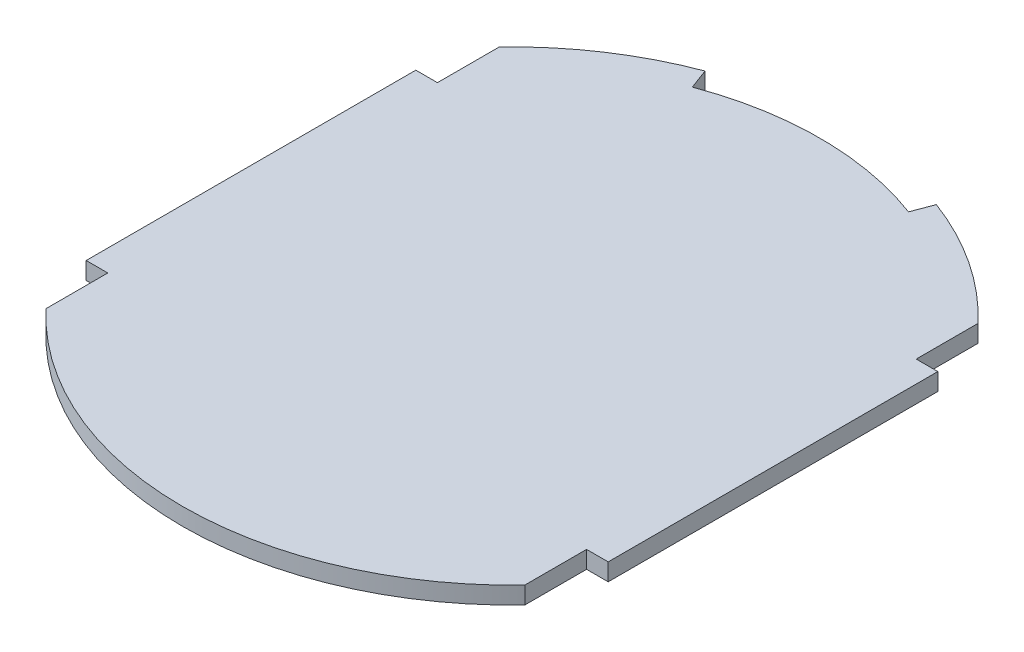
ISO-10303-21;
HEADER;
FILE_DESCRIPTION(('STEP AP214'),'2;1');
FILE_NAME('part.step','',(''),(''),'','','');
FILE_SCHEMA(('AUTOMOTIVE_DESIGN { 1 0 10303 214 1 1 1 1 }'));
ENDSEC;
DATA;
#1=APPLICATION_CONTEXT('core data for automotive mechanical design processes');
#2=APPLICATION_PROTOCOL_DEFINITION('international standard','automotive_design',2000,#1);
#3=PRODUCT_CONTEXT('',#1,'mechanical');
#4=PRODUCT('Part','Part','',(#3));
#5=PRODUCT_RELATED_PRODUCT_CATEGORY('part','',(#4));
#6=PRODUCT_DEFINITION_FORMATION('','',#4);
#7=PRODUCT_DEFINITION_CONTEXT('part definition',#1,'design');
#8=PRODUCT_DEFINITION('design','',#6,#7);
#9=PRODUCT_DEFINITION_SHAPE('','',#8);
#10=(LENGTH_UNIT() NAMED_UNIT(*) SI_UNIT(.MILLI.,.METRE.));
#11=(NAMED_UNIT(*) PLANE_ANGLE_UNIT() SI_UNIT($,.RADIAN.));
#12=(NAMED_UNIT(*) SI_UNIT($,.STERADIAN.) SOLID_ANGLE_UNIT());
#13=UNCERTAINTY_MEASURE_WITH_UNIT(LENGTH_MEASURE(1.E-05),#10,'distance_accuracy_value','');
#14=(GEOMETRIC_REPRESENTATION_CONTEXT(3) GLOBAL_UNCERTAINTY_ASSIGNED_CONTEXT((#13)) GLOBAL_UNIT_ASSIGNED_CONTEXT((#10,
#11,#12)) REPRESENTATION_CONTEXT('',''));
#15=CARTESIAN_POINT('',(0.,0.,0.));
#16=DIRECTION('',(0.,0.,1.));
#17=DIRECTION('',(1.,0.,0.));
#18=AXIS2_PLACEMENT_3D('',#15,#16,#17);
#19=CARTESIAN_POINT('',(0.,1.6,0.));
#20=DIRECTION('',(0.,-1.,0.));
#21=DIRECTION('',(0.,0.,-1.));
#22=AXIS2_PLACEMENT_3D('',#19,#20,#21);
#23=CYLINDRICAL_SURFACE('',#22,30.5);
#24=DIRECTION('',(0.,1.,0.));
#25=VECTOR('',#24,1.);
#26=CARTESIAN_POINT('',(-10.7017543859649,-8.4,-28.5608552578959));
#27=LINE('',#26,#25);
#28=CARTESIAN_POINT('',(-10.7017543859649,0.,-28.5608552578959));
#29=VERTEX_POINT('',#28);
#30=CARTESIAN_POINT('',(-10.7017543859649,1.6,-28.5608552578959));
#31=VERTEX_POINT('',#30);
#32=EDGE_CURVE('E178',#29,#31,#27,.T.);
#33=ORIENTED_EDGE('',*,*,#32,.F.);
#34=CARTESIAN_POINT('',(0.,0.,0.));
#35=DIRECTION('',(0.,1.,0.));
#36=DIRECTION('',(0.,0.,1.));
#37=AXIS2_PLACEMENT_3D('',#34,#35,#36);
#38=CIRCLE('',#37,30.5);
#39=CARTESIAN_POINT('',(-22.15,0.,-20.9672959629991));
#40=VERTEX_POINT('',#39);
#41=EDGE_CURVE('E195',#29,#40,#38,.T.);
#42=ORIENTED_EDGE('',*,*,#41,.T.);
#43=DIRECTION('',(0.,-1.,0.));
#44=VECTOR('',#43,1.);
#45=CARTESIAN_POINT('',(-22.15,1.6,-20.9672959629991));
#46=LINE('',#45,#44);
#47=CARTESIAN_POINT('',(-22.15,1.6,-20.9672959629991));
#48=VERTEX_POINT('',#47);
#49=EDGE_CURVE('E163',#48,#40,#46,.T.);
#50=ORIENTED_EDGE('',*,*,#49,.F.);
#51=CARTESIAN_POINT('',(0.,1.6,0.));
#52=DIRECTION('',(0.,1.,0.));
#53=DIRECTION('',(0.,0.,1.));
#54=AXIS2_PLACEMENT_3D('',#51,#52,#53);
#55=CIRCLE('',#54,30.5);
#56=EDGE_CURVE('E152',#31,#48,#55,.T.);
#57=ORIENTED_EDGE('',*,*,#56,.F.);
#58=EDGE_LOOP('',(#33,#42,#50,#57));
#59=FACE_BOUND('',#58,.T.);
#60=ADVANCED_FACE('F33',(#59),#23,.T.);
#61=CARTESIAN_POINT('',(-24.15,1.6,-15.25));
#62=DIRECTION('',(0.,0.,1.));
#63=DIRECTION('',(1.,0.,0.));
#64=AXIS2_PLACEMENT_3D('',#61,#62,#63);
#65=PLANE('',#64);
#66=DIRECTION('',(-1.,0.,0.));
#67=VECTOR('',#66,1.);
#68=CARTESIAN_POINT('',(-24.15,0.,-15.25));
#69=LINE('',#68,#67);
#70=CARTESIAN_POINT('',(-22.15,0.,-15.25));
#71=VERTEX_POINT('',#70);
#72=CARTESIAN_POINT('',(-24.15,0.,-15.25));
#73=VERTEX_POINT('',#72);
#74=EDGE_CURVE('E174',#71,#73,#69,.T.);
#75=ORIENTED_EDGE('',*,*,#74,.T.);
#76=DIRECTION('',(0.,-1.,0.));
#77=VECTOR('',#76,1.);
#78=CARTESIAN_POINT('',(-24.15,1.6,-15.25));
#79=LINE('',#78,#77);
#80=CARTESIAN_POINT('',(-24.15,1.6,-15.25));
#81=VERTEX_POINT('',#80);
#82=EDGE_CURVE('E224',#81,#73,#79,.T.);
#83=ORIENTED_EDGE('',*,*,#82,.F.);
#84=DIRECTION('',(-1.,0.,0.));
#85=VECTOR('',#84,1.);
#86=CARTESIAN_POINT('',(-24.15,1.6,-15.25));
#87=LINE('',#86,#85);
#88=CARTESIAN_POINT('',(-22.15,1.6,-15.25));
#89=VERTEX_POINT('',#88);
#90=EDGE_CURVE('E199',#89,#81,#87,.T.);
#91=ORIENTED_EDGE('',*,*,#90,.F.);
#92=DIRECTION('',(0.,-1.,0.));
#93=VECTOR('',#92,1.);
#94=CARTESIAN_POINT('',(-22.15,1.6,-15.25));
#95=LINE('',#94,#93);
#96=EDGE_CURVE('E170',#89,#71,#95,.T.);
#97=ORIENTED_EDGE('',*,*,#96,.T.);
#98=EDGE_LOOP('',(#75,#83,#91,#97));
#99=FACE_BOUND('',#98,.T.);
#100=ADVANCED_FACE('F35',(#99),#65,.F.);
#101=CARTESIAN_POINT('',(-24.15,1.6,-15.25));
#102=DIRECTION('',(1.,0.,0.));
#103=DIRECTION('',(0.,0.,-1.));
#104=AXIS2_PLACEMENT_3D('',#101,#102,#103);
#105=PLANE('',#104);
#106=DIRECTION('',(0.,0.,1.));
#107=VECTOR('',#106,1.);
#108=CARTESIAN_POINT('',(-24.15,0.,-15.25));
#109=LINE('',#108,#107);
#110=CARTESIAN_POINT('',(-24.15,0.,15.25));
#111=VERTEX_POINT('',#110);
#112=EDGE_CURVE('E177',#73,#111,#109,.T.);
#113=ORIENTED_EDGE('',*,*,#112,.T.);
#114=DIRECTION('',(0.,-1.,0.));
#115=VECTOR('',#114,1.);
#116=CARTESIAN_POINT('',(-24.15,1.6,15.25));
#117=LINE('',#116,#115);
#118=CARTESIAN_POINT('',(-24.15,1.6,15.25));
#119=VERTEX_POINT('',#118);
#120=EDGE_CURVE('E221',#119,#111,#117,.T.);
#121=ORIENTED_EDGE('',*,*,#120,.F.);
#122=DIRECTION('',(0.,0.,1.));
#123=VECTOR('',#122,1.);
#124=CARTESIAN_POINT('',(-24.15,1.6,-15.25));
#125=LINE('',#124,#123);
#126=EDGE_CURVE('E111',#81,#119,#125,.T.);
#127=ORIENTED_EDGE('',*,*,#126,.F.);
#128=ORIENTED_EDGE('',*,*,#82,.T.);
#129=EDGE_LOOP('',(#113,#121,#127,#128));
#130=FACE_BOUND('',#129,.T.);
#131=ADVANCED_FACE('F294',(#130),#105,.F.);
#132=CARTESIAN_POINT('',(-24.15,1.6,15.25));
#133=DIRECTION('',(0.,0.,-1.));
#134=DIRECTION('',(-1.,0.,0.));
#135=AXIS2_PLACEMENT_3D('',#132,#133,#134);
#136=PLANE('',#135);
#137=DIRECTION('',(1.,0.,0.));
#138=VECTOR('',#137,1.);
#139=CARTESIAN_POINT('',(-24.15,0.,15.25));
#140=LINE('',#139,#138);
#141=CARTESIAN_POINT('',(-22.15,0.,15.25));
#142=VERTEX_POINT('',#141);
#143=EDGE_CURVE('E180',#111,#142,#140,.T.);
#144=ORIENTED_EDGE('',*,*,#143,.T.);
#145=DIRECTION('',(0.,-1.,0.));
#146=VECTOR('',#145,1.);
#147=CARTESIAN_POINT('',(-22.15,1.6,15.25));
#148=LINE('',#147,#146);
#149=CARTESIAN_POINT('',(-22.15,1.6,15.25));
#150=VERTEX_POINT('',#149);
#151=EDGE_CURVE('E218',#150,#142,#148,.T.);
#152=ORIENTED_EDGE('',*,*,#151,.F.);
#153=DIRECTION('',(1.,0.,0.));
#154=VECTOR('',#153,1.);
#155=CARTESIAN_POINT('',(-24.15,1.6,15.25));
#156=LINE('',#155,#154);
#157=EDGE_CURVE('E250',#119,#150,#156,.T.);
#158=ORIENTED_EDGE('',*,*,#157,.F.);
#159=ORIENTED_EDGE('',*,*,#120,.T.);
#160=EDGE_LOOP('',(#144,#152,#158,#159));
#161=FACE_BOUND('',#160,.T.);
#162=ADVANCED_FACE('F293',(#161),#136,.F.);
#163=CARTESIAN_POINT('',(-22.15,1.6,20.9672959629991));
#164=DIRECTION('',(1.,0.,0.));
#165=DIRECTION('',(0.,0.,-1.));
#166=AXIS2_PLACEMENT_3D('',#163,#164,#165);
#167=PLANE('',#166);
#168=DIRECTION('',(0.,0.,1.));
#169=VECTOR('',#168,1.);
#170=CARTESIAN_POINT('',(-22.15,0.,20.9672959629991));
#171=LINE('',#170,#169);
#172=CARTESIAN_POINT('',(-22.15,0.,20.9672959629991));
#173=VERTEX_POINT('',#172);
#174=EDGE_CURVE('E182',#142,#173,#171,.T.);
#175=ORIENTED_EDGE('',*,*,#174,.T.);
#176=DIRECTION('',(0.,-1.,0.));
#177=VECTOR('',#176,1.);
#178=CARTESIAN_POINT('',(-22.15,1.6,20.9672959629991));
#179=LINE('',#178,#177);
#180=CARTESIAN_POINT('',(-22.15,1.6,20.9672959629991));
#181=VERTEX_POINT('',#180);
#182=EDGE_CURVE('E215',#181,#173,#179,.T.);
#183=ORIENTED_EDGE('',*,*,#182,.F.);
#184=DIRECTION('',(0.,0.,1.));
#185=VECTOR('',#184,1.);
#186=CARTESIAN_POINT('',(-22.15,1.6,20.9672959629991));
#187=LINE('',#186,#185);
#188=EDGE_CURVE('E252',#150,#181,#187,.T.);
#189=ORIENTED_EDGE('',*,*,#188,.F.);
#190=ORIENTED_EDGE('',*,*,#151,.T.);
#191=EDGE_LOOP('',(#175,#183,#189,#190));
#192=FACE_BOUND('',#191,.T.);
#193=ADVANCED_FACE('F288',(#192),#167,.F.);
#194=CARTESIAN_POINT('',(0.,1.6,0.));
#195=DIRECTION('',(0.,-1.,0.));
#196=DIRECTION('',(0.,0.,-1.));
#197=AXIS2_PLACEMENT_3D('',#194,#195,#196);
#198=CYLINDRICAL_SURFACE('',#197,30.5);
#199=CARTESIAN_POINT('',(0.,0.,0.));
#200=DIRECTION('',(0.,1.,0.));
#201=DIRECTION('',(0.,0.,1.));
#202=AXIS2_PLACEMENT_3D('',#199,#200,#201);
#203=CIRCLE('',#202,30.5);
#204=CARTESIAN_POINT('',(22.15,0.,20.9672959629991));
#205=VERTEX_POINT('',#204);
#206=EDGE_CURVE('E184',#173,#205,#203,.T.);
#207=ORIENTED_EDGE('',*,*,#206,.T.);
#208=DIRECTION('',(0.,-1.,0.));
#209=VECTOR('',#208,1.);
#210=CARTESIAN_POINT('',(22.15,1.6,20.9672959629991));
#211=LINE('',#210,#209);
#212=CARTESIAN_POINT('',(22.15,1.6,20.9672959629991));
#213=VERTEX_POINT('',#212);
#214=EDGE_CURVE('E212',#213,#205,#211,.T.);
#215=ORIENTED_EDGE('',*,*,#214,.F.);
#216=CARTESIAN_POINT('',(0.,1.6,0.));
#217=DIRECTION('',(0.,1.,0.));
#218=DIRECTION('',(0.,0.,1.));
#219=AXIS2_PLACEMENT_3D('',#216,#217,#218);
#220=CIRCLE('',#219,30.5);
#221=EDGE_CURVE('E254',#181,#213,#220,.T.);
#222=ORIENTED_EDGE('',*,*,#221,.F.);
#223=ORIENTED_EDGE('',*,*,#182,.T.);
#224=EDGE_LOOP('',(#207,#215,#222,#223));
#225=FACE_BOUND('',#224,.T.);
#226=ADVANCED_FACE('F283',(#225),#198,.T.);
#227=CARTESIAN_POINT('',(22.15,1.6,15.25));
#228=DIRECTION('',(-1.,0.,0.));
#229=DIRECTION('',(0.,0.,1.));
#230=AXIS2_PLACEMENT_3D('',#227,#228,#229);
#231=PLANE('',#230);
#232=DIRECTION('',(0.,0.,-1.));
#233=VECTOR('',#232,1.);
#234=CARTESIAN_POINT('',(22.15,0.,15.25));
#235=LINE('',#234,#233);
#236=CARTESIAN_POINT('',(22.15,0.,15.25));
#237=VERTEX_POINT('',#236);
#238=EDGE_CURVE('E186',#205,#237,#235,.T.);
#239=ORIENTED_EDGE('',*,*,#238,.T.);
#240=DIRECTION('',(0.,-1.,0.));
#241=VECTOR('',#240,1.);
#242=CARTESIAN_POINT('',(22.15,1.6,15.25));
#243=LINE('',#242,#241);
#244=CARTESIAN_POINT('',(22.15,1.6,15.25));
#245=VERTEX_POINT('',#244);
#246=EDGE_CURVE('E209',#245,#237,#243,.T.);
#247=ORIENTED_EDGE('',*,*,#246,.F.);
#248=DIRECTION('',(0.,0.,-1.));
#249=VECTOR('',#248,1.);
#250=CARTESIAN_POINT('',(22.15,1.6,15.25));
#251=LINE('',#250,#249);
#252=EDGE_CURVE('E256',#213,#245,#251,.T.);
#253=ORIENTED_EDGE('',*,*,#252,.F.);
#254=ORIENTED_EDGE('',*,*,#214,.T.);
#255=EDGE_LOOP('',(#239,#247,#253,#254));
#256=FACE_BOUND('',#255,.T.);
#257=ADVANCED_FACE('F279',(#256),#231,.F.);
#258=CARTESIAN_POINT('',(22.15,1.6,15.25));
#259=DIRECTION('',(0.,0.,-1.));
#260=DIRECTION('',(-1.,0.,0.));
#261=AXIS2_PLACEMENT_3D('',#258,#259,#260);
#262=PLANE('',#261);
#263=DIRECTION('',(1.,0.,0.));
#264=VECTOR('',#263,1.);
#265=CARTESIAN_POINT('',(22.15,0.,15.25));
#266=LINE('',#265,#264);
#267=CARTESIAN_POINT('',(24.15,0.,15.25));
#268=VERTEX_POINT('',#267);
#269=EDGE_CURVE('E188',#237,#268,#266,.T.);
#270=ORIENTED_EDGE('',*,*,#269,.T.);
#271=DIRECTION('',(0.,-1.,0.));
#272=VECTOR('',#271,1.);
#273=CARTESIAN_POINT('',(24.15,1.6,15.25));
#274=LINE('',#273,#272);
#275=CARTESIAN_POINT('',(24.15,1.6,15.25));
#276=VERTEX_POINT('',#275);
#277=EDGE_CURVE('E206',#276,#268,#274,.T.);
#278=ORIENTED_EDGE('',*,*,#277,.F.);
#279=DIRECTION('',(1.,0.,0.));
#280=VECTOR('',#279,1.);
#281=CARTESIAN_POINT('',(22.15,1.6,15.25));
#282=LINE('',#281,#280);
#283=EDGE_CURVE('E258',#245,#276,#282,.T.);
#284=ORIENTED_EDGE('',*,*,#283,.F.);
#285=ORIENTED_EDGE('',*,*,#246,.T.);
#286=EDGE_LOOP('',(#270,#278,#284,#285));
#287=FACE_BOUND('',#286,.T.);
#288=ADVANCED_FACE('F275',(#287),#262,.F.);
#289=CARTESIAN_POINT('',(24.15,1.6,15.25));
#290=DIRECTION('',(-1.,0.,0.));
#291=DIRECTION('',(0.,0.,1.));
#292=AXIS2_PLACEMENT_3D('',#289,#290,#291);
#293=PLANE('',#292);
#294=DIRECTION('',(0.,0.,-1.));
#295=VECTOR('',#294,1.);
#296=CARTESIAN_POINT('',(24.15,0.,15.25));
#297=LINE('',#296,#295);
#298=CARTESIAN_POINT('',(24.15,0.,-15.25));
#299=VERTEX_POINT('',#298);
#300=EDGE_CURVE('E190',#268,#299,#297,.T.);
#301=ORIENTED_EDGE('',*,*,#300,.T.);
#302=DIRECTION('',(0.,-1.,0.));
#303=VECTOR('',#302,1.);
#304=CARTESIAN_POINT('',(24.15,1.6,-15.25));
#305=LINE('',#304,#303);
#306=CARTESIAN_POINT('',(24.15,1.6,-15.25));
#307=VERTEX_POINT('',#306);
#308=EDGE_CURVE('E203',#307,#299,#305,.T.);
#309=ORIENTED_EDGE('',*,*,#308,.F.);
#310=DIRECTION('',(0.,0.,-1.));
#311=VECTOR('',#310,1.);
#312=CARTESIAN_POINT('',(24.15,1.6,15.25));
#313=LINE('',#312,#311);
#314=EDGE_CURVE('E260',#276,#307,#313,.T.);
#315=ORIENTED_EDGE('',*,*,#314,.F.);
#316=ORIENTED_EDGE('',*,*,#277,.T.);
#317=EDGE_LOOP('',(#301,#309,#315,#316));
#318=FACE_BOUND('',#317,.T.);
#319=ADVANCED_FACE('F266',(#318),#293,.F.);
#320=CARTESIAN_POINT('',(22.15,1.6,-15.25));
#321=DIRECTION('',(0.,0.,1.));
#322=DIRECTION('',(1.,0.,0.));
#323=AXIS2_PLACEMENT_3D('',#320,#321,#322);
#324=PLANE('',#323);
#325=DIRECTION('',(-1.,0.,0.));
#326=VECTOR('',#325,1.);
#327=CARTESIAN_POINT('',(22.15,0.,-15.25));
#328=LINE('',#327,#326);
#329=CARTESIAN_POINT('',(22.15,0.,-15.25));
#330=VERTEX_POINT('',#329);
#331=EDGE_CURVE('E192',#299,#330,#328,.T.);
#332=ORIENTED_EDGE('',*,*,#331,.T.);
#333=DIRECTION('',(0.,-1.,0.));
#334=VECTOR('',#333,1.);
#335=CARTESIAN_POINT('',(22.15,1.6,-15.25));
#336=LINE('',#335,#334);
#337=CARTESIAN_POINT('',(22.15,1.6,-15.25));
#338=VERTEX_POINT('',#337);
#339=EDGE_CURVE('E162',#338,#330,#336,.T.);
#340=ORIENTED_EDGE('',*,*,#339,.F.);
#341=DIRECTION('',(-1.,0.,0.));
#342=VECTOR('',#341,1.);
#343=CARTESIAN_POINT('',(22.15,1.6,-15.25));
#344=LINE('',#343,#342);
#345=EDGE_CURVE('E148',#307,#338,#344,.T.);
#346=ORIENTED_EDGE('',*,*,#345,.F.);
#347=ORIENTED_EDGE('',*,*,#308,.T.);
#348=EDGE_LOOP('',(#332,#340,#346,#347));
#349=FACE_BOUND('',#348,.T.);
#350=ADVANCED_FACE('F270',(#349),#324,.F.);
#351=CARTESIAN_POINT('',(22.15,1.6,-20.9672959629991));
#352=DIRECTION('',(-1.,0.,0.));
#353=DIRECTION('',(0.,0.,1.));
#354=AXIS2_PLACEMENT_3D('',#351,#352,#353);
#355=PLANE('',#354);
#356=DIRECTION('',(0.,0.,-1.));
#357=VECTOR('',#356,1.);
#358=CARTESIAN_POINT('',(22.15,0.,-20.9672959629991));
#359=LINE('',#358,#357);
#360=CARTESIAN_POINT('',(22.15,0.,-20.9672959629991));
#361=VERTEX_POINT('',#360);
#362=EDGE_CURVE('E158',#330,#361,#359,.T.);
#363=ORIENTED_EDGE('',*,*,#362,.T.);
#364=DIRECTION('',(0.,-1.,0.));
#365=VECTOR('',#364,1.);
#366=CARTESIAN_POINT('',(22.15,1.6,-20.9672959629991));
#367=LINE('',#366,#365);
#368=CARTESIAN_POINT('',(22.15,1.6,-20.9672959629991));
#369=VERTEX_POINT('',#368);
#370=EDGE_CURVE('E155',#369,#361,#367,.T.);
#371=ORIENTED_EDGE('',*,*,#370,.F.);
#372=DIRECTION('',(0.,0.,-1.));
#373=VECTOR('',#372,1.);
#374=CARTESIAN_POINT('',(22.15,1.6,-20.9672959629991));
#375=LINE('',#374,#373);
#376=EDGE_CURVE('E139',#338,#369,#375,.T.);
#377=ORIENTED_EDGE('',*,*,#376,.F.);
#378=ORIENTED_EDGE('',*,*,#339,.T.);
#379=EDGE_LOOP('',(#363,#371,#377,#378));
#380=FACE_BOUND('',#379,.T.);
#381=ADVANCED_FACE('F156',(#380),#355,.F.);
#382=CARTESIAN_POINT('',(10.7017543859649,0.,-28.5608552578959));
#383=VERTEX_POINT('',#382);
#384=EDGE_CURVE('E196',#361,#383,#38,.T.);
#385=ORIENTED_EDGE('',*,*,#384,.T.);
#386=DIRECTION('',(0.,1.,0.));
#387=VECTOR('',#386,1.);
#388=CARTESIAN_POINT('',(10.7017543859649,-8.4,-28.5608552578959));
#389=LINE('',#388,#387);
#390=CARTESIAN_POINT('',(10.7017543859649,1.6,-28.5608552578959));
#391=VERTEX_POINT('',#390);
#392=EDGE_CURVE('E168',#383,#391,#389,.T.);
#393=ORIENTED_EDGE('',*,*,#392,.T.);
#394=EDGE_CURVE('E146',#369,#391,#55,.T.);
#395=ORIENTED_EDGE('',*,*,#394,.F.);
#396=ORIENTED_EDGE('',*,*,#370,.T.);
#397=EDGE_LOOP('',(#385,#393,#395,#396));
#398=FACE_BOUND('',#397,.T.);
#399=ADVANCED_FACE('F166',(#398),#23,.T.);
#400=CARTESIAN_POINT('',(-22.15,1.6,-15.25));
#401=DIRECTION('',(1.,0.,0.));
#402=DIRECTION('',(0.,0.,-1.));
#403=AXIS2_PLACEMENT_3D('',#400,#401,#402);
#404=PLANE('',#403);
#405=DIRECTION('',(0.,0.,1.));
#406=VECTOR('',#405,1.);
#407=CARTESIAN_POINT('',(-22.15,0.,-15.25));
#408=LINE('',#407,#406);
#409=EDGE_CURVE('E102',#40,#71,#408,.T.);
#410=ORIENTED_EDGE('',*,*,#409,.T.);
#411=ORIENTED_EDGE('',*,*,#96,.F.);
#412=DIRECTION('',(0.,0.,1.));
#413=VECTOR('',#412,1.);
#414=CARTESIAN_POINT('',(-22.15,1.6,-15.25));
#415=LINE('',#414,#413);
#416=EDGE_CURVE('E57',#48,#89,#415,.T.);
#417=ORIENTED_EDGE('',*,*,#416,.F.);
#418=ORIENTED_EDGE('',*,*,#49,.T.);
#419=EDGE_LOOP('',(#410,#411,#417,#418));
#420=FACE_BOUND('',#419,.T.);
#421=ADVANCED_FACE('F300',(#420),#404,.F.);
#422=CARTESIAN_POINT('',(0.,1.6,0.));
#423=DIRECTION('',(0.,1.,0.));
#424=DIRECTION('',(0.,0.,1.));
#425=AXIS2_PLACEMENT_3D('',#422,#423,#424);
#426=PLANE('',#425);
#427=CARTESIAN_POINT('',(0.,1.6,0.));
#428=DIRECTION('',(0.,1.,0.));
#429=DIRECTION('',(0.,0.,1.));
#430=AXIS2_PLACEMENT_3D('',#427,#428,#429);
#431=CIRCLE('',#430,28.5);
#432=CARTESIAN_POINT('',(-10.,1.6,-26.688012290165));
#433=VERTEX_POINT('',#432);
#434=CARTESIAN_POINT('',(10.,1.6,-26.688012290165));
#435=VERTEX_POINT('',#434);
#436=EDGE_CURVE('E315',#433,#435,#431,.F.);
#437=ORIENTED_EDGE('',*,*,#436,.F.);
#438=DIRECTION('',(-0.350877192982456,0.,-0.93642148386544));
#439=VECTOR('',#438,1.);
#440=CARTESIAN_POINT('',(0.,1.6,0.));
#441=LINE('',#440,#439);
#442=EDGE_CURVE('E312',#433,#31,#441,.T.);
#443=ORIENTED_EDGE('',*,*,#442,.T.);
#444=ORIENTED_EDGE('',*,*,#56,.T.);
#445=ORIENTED_EDGE('',*,*,#416,.T.);
#446=ORIENTED_EDGE('',*,*,#90,.T.);
#447=ORIENTED_EDGE('',*,*,#126,.T.);
#448=ORIENTED_EDGE('',*,*,#157,.T.);
#449=ORIENTED_EDGE('',*,*,#188,.T.);
#450=ORIENTED_EDGE('',*,*,#221,.T.);
#451=ORIENTED_EDGE('',*,*,#252,.T.);
#452=ORIENTED_EDGE('',*,*,#283,.T.);
#453=ORIENTED_EDGE('',*,*,#314,.T.);
#454=ORIENTED_EDGE('',*,*,#345,.T.);
#455=ORIENTED_EDGE('',*,*,#376,.T.);
#456=ORIENTED_EDGE('',*,*,#394,.T.);
#457=DIRECTION('',(0.350877192982456,0.,-0.93642148386544));
#458=VECTOR('',#457,1.);
#459=CARTESIAN_POINT('',(0.,1.6,0.));
#460=LINE('',#459,#458);
#461=EDGE_CURVE('E238',#435,#391,#460,.T.);
#462=ORIENTED_EDGE('',*,*,#461,.F.);
#463=EDGE_LOOP('',(#437,#443,#444,#445,#446,#447,#448,#449,#450,#451,#452,#453,#454,#455,#456,#462));
#464=FACE_BOUND('',#463,.T.);
#465=ADVANCED_FACE('F142',(#464),#426,.T.);
#466=CARTESIAN_POINT('',(0.,0.,0.));
#467=DIRECTION('',(0.,1.,0.));
#468=DIRECTION('',(0.,0.,1.));
#469=AXIS2_PLACEMENT_3D('',#466,#467,#468);
#470=PLANE('',#469);
#471=DIRECTION('',(-0.350877192982456,0.,-0.93642148386544));
#472=VECTOR('',#471,1.);
#473=CARTESIAN_POINT('',(0.,0.,0.));
#474=LINE('',#473,#472);
#475=CARTESIAN_POINT('',(-10.,0.,-26.688012290165));
#476=VERTEX_POINT('',#475);
#477=EDGE_CURVE('E11',#476,#29,#474,.T.);
#478=ORIENTED_EDGE('',*,*,#477,.F.);
#479=CARTESIAN_POINT('',(0.,0.,0.));
#480=DIRECTION('',(0.,1.,0.));
#481=DIRECTION('',(0.,0.,1.));
#482=AXIS2_PLACEMENT_3D('',#479,#480,#481);
#483=CIRCLE('',#482,28.5);
#484=CARTESIAN_POINT('',(10.,0.,-26.688012290165));
#485=VERTEX_POINT('',#484);
#486=EDGE_CURVE('E226',#476,#485,#483,.F.);
#487=ORIENTED_EDGE('',*,*,#486,.T.);
#488=DIRECTION('',(0.350877192982456,0.,-0.93642148386544));
#489=VECTOR('',#488,1.);
#490=CARTESIAN_POINT('',(0.,0.,0.));
#491=LINE('',#490,#489);
#492=EDGE_CURVE('E41',#485,#383,#491,.T.);
#493=ORIENTED_EDGE('',*,*,#492,.T.);
#494=ORIENTED_EDGE('',*,*,#384,.F.);
#495=ORIENTED_EDGE('',*,*,#362,.F.);
#496=ORIENTED_EDGE('',*,*,#331,.F.);
#497=ORIENTED_EDGE('',*,*,#300,.F.);
#498=ORIENTED_EDGE('',*,*,#269,.F.);
#499=ORIENTED_EDGE('',*,*,#238,.F.);
#500=ORIENTED_EDGE('',*,*,#206,.F.);
#501=ORIENTED_EDGE('',*,*,#174,.F.);
#502=ORIENTED_EDGE('',*,*,#143,.F.);
#503=ORIENTED_EDGE('',*,*,#112,.F.);
#504=ORIENTED_EDGE('',*,*,#74,.F.);
#505=ORIENTED_EDGE('',*,*,#409,.F.);
#506=ORIENTED_EDGE('',*,*,#41,.F.);
#507=EDGE_LOOP('',(#478,#487,#493,#494,#495,#496,#497,#498,#499,#500,#501,#502,#503,#504,#505,#506));
#508=FACE_BOUND('',#507,.T.);
#509=ADVANCED_FACE('F232',(#508),#470,.F.);
#510=CARTESIAN_POINT('',(0.,-8.4,0.));
#511=DIRECTION('',(0.93642148386544,0.,-0.350877192982456));
#512=DIRECTION('',(-0.350877192982456,0.,-0.93642148386544));
#513=AXIS2_PLACEMENT_3D('',#510,#511,#512);
#514=PLANE('',#513);
#515=ORIENTED_EDGE('',*,*,#477,.T.);
#516=ORIENTED_EDGE('',*,*,#32,.T.);
#517=ORIENTED_EDGE('',*,*,#442,.F.);
#518=DIRECTION('',(0.,1.,0.));
#519=VECTOR('',#518,1.);
#520=CARTESIAN_POINT('',(-10.,-8.4,-26.688012290165));
#521=LINE('',#520,#519);
#522=EDGE_CURVE('E242',#476,#433,#521,.T.);
#523=ORIENTED_EDGE('',*,*,#522,.F.);
#524=EDGE_LOOP('',(#515,#516,#517,#523));
#525=FACE_BOUND('',#524,.T.);
#526=ADVANCED_FACE('F308',(#525),#514,.T.);
#527=CARTESIAN_POINT('',(0.,-8.4,0.));
#528=DIRECTION('',(0.93642148386544,0.,0.350877192982456));
#529=DIRECTION('',(0.350877192982456,0.,-0.93642148386544));
#530=AXIS2_PLACEMENT_3D('',#527,#528,#529);
#531=PLANE('',#530);
#532=DIRECTION('',(0.,1.,0.));
#533=VECTOR('',#532,1.);
#534=CARTESIAN_POINT('',(10.,-8.4,-26.688012290165));
#535=LINE('',#534,#533);
#536=EDGE_CURVE('E48',#485,#435,#535,.T.);
#537=ORIENTED_EDGE('',*,*,#536,.T.);
#538=ORIENTED_EDGE('',*,*,#461,.T.);
#539=ORIENTED_EDGE('',*,*,#392,.F.);
#540=ORIENTED_EDGE('',*,*,#492,.F.);
#541=EDGE_LOOP('',(#537,#538,#539,#540));
#542=FACE_BOUND('',#541,.T.);
#543=ADVANCED_FACE('F235',(#542),#531,.F.);
#544=CARTESIAN_POINT('',(0.,-8.4,0.));
#545=DIRECTION('',(0.,1.,0.));
#546=DIRECTION('',(0.,0.,1.));
#547=AXIS2_PLACEMENT_3D('',#544,#545,#546);
#548=CYLINDRICAL_SURFACE('',#547,28.5);
#549=ORIENTED_EDGE('',*,*,#522,.T.);
#550=ORIENTED_EDGE('',*,*,#436,.T.);
#551=ORIENTED_EDGE('',*,*,#536,.F.);
#552=ORIENTED_EDGE('',*,*,#486,.F.);
#553=EDGE_LOOP('',(#549,#550,#551,#552));
#554=FACE_BOUND('',#553,.T.);
#555=ADVANCED_FACE('F314',(#554),#548,.T.);
#556=CLOSED_SHELL('',(#60,#100,#131,#162,#193,#226,#257,#288,#319,#350,#381,#399,#421,#465,#509,
#526,#543,#555));
#557=MANIFOLD_SOLID_BREP('B2',#556);
#558=ADVANCED_BREP_SHAPE_REPRESENTATION('',(#18,#557),#14);
#559=SHAPE_DEFINITION_REPRESENTATION(#9,#558);
ENDSEC;
END-ISO-10303-21;
